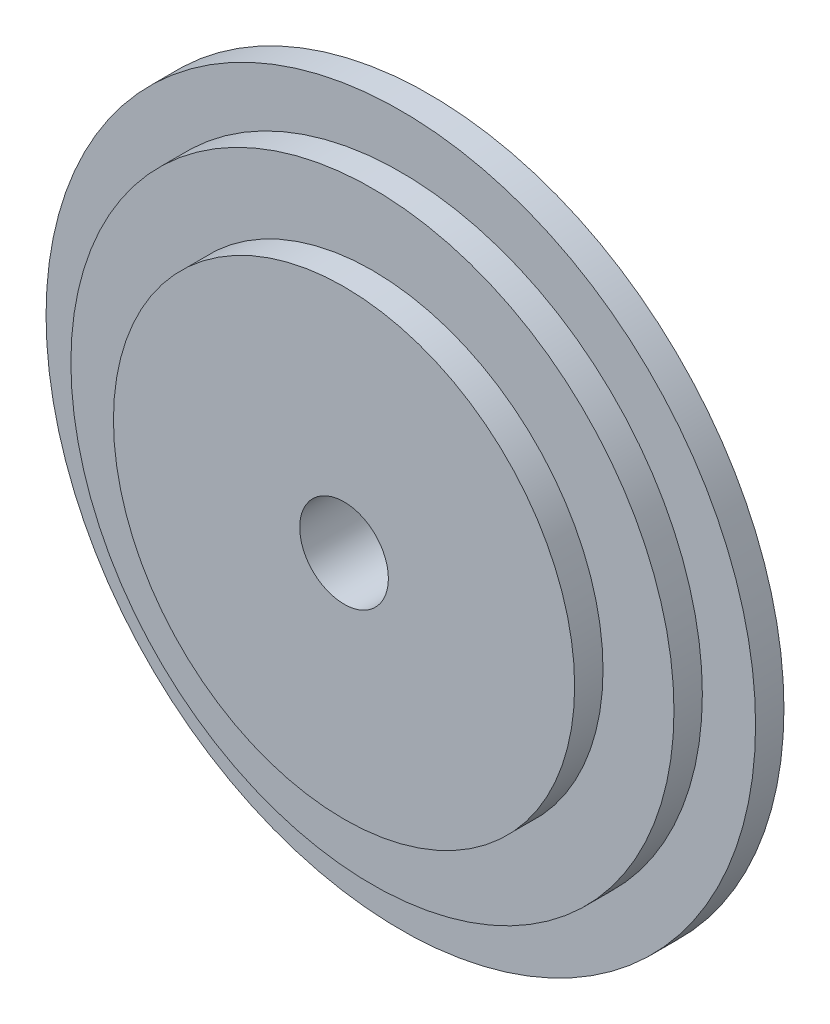
ISO-10303-21;
HEADER;
FILE_DESCRIPTION(('STEP AP214'),'2;1');
FILE_NAME('part.step','',(''),(''),'','','');
FILE_SCHEMA(('AUTOMOTIVE_DESIGN { 1 0 10303 214 1 1 1 1 }'));
ENDSEC;
DATA;
#1=APPLICATION_CONTEXT('core data for automotive mechanical design processes');
#2=APPLICATION_PROTOCOL_DEFINITION('international standard','automotive_design',2000,#1);
#3=PRODUCT_CONTEXT('',#1,'mechanical');
#4=PRODUCT('Part','Part','',(#3));
#5=PRODUCT_RELATED_PRODUCT_CATEGORY('part','',(#4));
#6=PRODUCT_DEFINITION_FORMATION('','',#4);
#7=PRODUCT_DEFINITION_CONTEXT('part definition',#1,'design');
#8=PRODUCT_DEFINITION('design','',#6,#7);
#9=PRODUCT_DEFINITION_SHAPE('','',#8);
#10=(LENGTH_UNIT() NAMED_UNIT(*) SI_UNIT(.MILLI.,.METRE.));
#11=(NAMED_UNIT(*) PLANE_ANGLE_UNIT() SI_UNIT($,.RADIAN.));
#12=(NAMED_UNIT(*) SI_UNIT($,.STERADIAN.) SOLID_ANGLE_UNIT());
#13=UNCERTAINTY_MEASURE_WITH_UNIT(LENGTH_MEASURE(1.E-05),#10,'distance_accuracy_value','');
#14=(GEOMETRIC_REPRESENTATION_CONTEXT(3) GLOBAL_UNCERTAINTY_ASSIGNED_CONTEXT((#13)) GLOBAL_UNIT_ASSIGNED_CONTEXT((#10,
#11,#12)) REPRESENTATION_CONTEXT('',''));
#15=CARTESIAN_POINT('',(0.,0.,0.));
#16=DIRECTION('',(0.,0.,1.));
#17=DIRECTION('',(1.,0.,0.));
#18=AXIS2_PLACEMENT_3D('',#15,#16,#17);
#19=CARTESIAN_POINT('',(0.,0.,8.));
#20=DIRECTION('',(0.,0.,-1.));
#21=DIRECTION('',(-1.,0.,0.));
#22=AXIS2_PLACEMENT_3D('',#19,#20,#21);
#23=CYLINDRICAL_SURFACE('',#22,100.);
#24=CARTESIAN_POINT('',(0.,0.,8.));
#25=DIRECTION('',(0.,0.,1.));
#26=DIRECTION('',(1.,0.,0.));
#27=AXIS2_PLACEMENT_3D('',#24,#25,#26);
#28=CIRCLE('',#27,100.);
#29=CARTESIAN_POINT('',(100.,0.,8.));
#30=VERTEX_POINT('',#29);
#31=EDGE_CURVE('E10',#30,#30,#28,.T.);
#32=ORIENTED_EDGE('',*,*,#31,.F.);
#33=EDGE_LOOP('',(#32));
#34=FACE_BOUND('',#33,.T.);
#35=CARTESIAN_POINT('',(0.,0.,0.));
#36=DIRECTION('',(0.,0.,1.));
#37=DIRECTION('',(1.,0.,0.));
#38=AXIS2_PLACEMENT_3D('',#35,#36,#37);
#39=CIRCLE('',#38,100.);
#40=CARTESIAN_POINT('',(100.,0.,0.));
#41=VERTEX_POINT('',#40);
#42=EDGE_CURVE('E33',#41,#41,#39,.T.);
#43=ORIENTED_EDGE('',*,*,#42,.T.);
#44=EDGE_LOOP('',(#43));
#45=FACE_BOUND('',#44,.T.);
#46=ADVANCED_FACE('F30',(#34,#45),#23,.T.);
#47=CARTESIAN_POINT('',(0.,0.,8.));
#48=DIRECTION('',(0.,0.,1.));
#49=DIRECTION('',(1.,0.,0.));
#50=AXIS2_PLACEMENT_3D('',#47,#48,#49);
#51=PLANE('',#50);
#52=CARTESIAN_POINT('',(0.,0.,8.));
#53=DIRECTION('',(0.,0.,1.));
#54=DIRECTION('',(1.,0.,0.));
#55=AXIS2_PLACEMENT_3D('',#52,#53,#54);
#56=CIRCLE('',#55,85.);
#57=CARTESIAN_POINT('',(85.,0.,8.));
#58=VERTEX_POINT('',#57);
#59=EDGE_CURVE('E42',#58,#58,#56,.T.);
#60=ORIENTED_EDGE('',*,*,#59,.F.);
#61=EDGE_LOOP('',(#60));
#62=FACE_BOUND('',#61,.T.);
#63=ORIENTED_EDGE('',*,*,#31,.T.);
#64=EDGE_LOOP('',(#63));
#65=FACE_BOUND('',#64,.T.);
#66=ADVANCED_FACE('F93',(#62,#65),#51,.T.);
#67=CARTESIAN_POINT('',(0.,0.,0.));
#68=DIRECTION('',(0.,0.,1.));
#69=DIRECTION('',(1.,0.,0.));
#70=AXIS2_PLACEMENT_3D('',#67,#68,#69);
#71=PLANE('',#70);
#72=CARTESIAN_POINT('',(0.,0.,0.));
#73=DIRECTION('',(0.,0.,1.));
#74=DIRECTION('',(1.,0.,0.));
#75=AXIS2_PLACEMENT_3D('',#72,#73,#74);
#76=CIRCLE('',#75,12.5);
#77=CARTESIAN_POINT('',(12.5,0.,0.));
#78=VERTEX_POINT('',#77);
#79=EDGE_CURVE('E51',#78,#78,#76,.T.);
#80=ORIENTED_EDGE('',*,*,#79,.T.);
#81=EDGE_LOOP('',(#80));
#82=FACE_BOUND('',#81,.T.);
#83=ORIENTED_EDGE('',*,*,#42,.F.);
#84=EDGE_LOOP('',(#83));
#85=FACE_BOUND('',#84,.T.);
#86=ADVANCED_FACE('F60',(#82,#85),#71,.F.);
#87=CARTESIAN_POINT('',(0.,0.,16.));
#88=DIRECTION('',(0.,0.,-1.));
#89=DIRECTION('',(-1.,0.,0.));
#90=AXIS2_PLACEMENT_3D('',#87,#88,#89);
#91=CYLINDRICAL_SURFACE('',#90,85.);
#92=CARTESIAN_POINT('',(0.,0.,16.));
#93=DIRECTION('',(0.,0.,1.));
#94=DIRECTION('',(1.,0.,0.));
#95=AXIS2_PLACEMENT_3D('',#92,#93,#94);
#96=CIRCLE('',#95,85.);
#97=CARTESIAN_POINT('',(85.,0.,16.));
#98=VERTEX_POINT('',#97);
#99=EDGE_CURVE('E40',#98,#98,#96,.T.);
#100=ORIENTED_EDGE('',*,*,#99,.F.);
#101=EDGE_LOOP('',(#100));
#102=FACE_BOUND('',#101,.T.);
#103=ORIENTED_EDGE('',*,*,#59,.T.);
#104=EDGE_LOOP('',(#103));
#105=FACE_BOUND('',#104,.T.);
#106=ADVANCED_FACE('F84',(#102,#105),#91,.T.);
#107=CARTESIAN_POINT('',(0.,0.,16.));
#108=DIRECTION('',(0.,0.,1.));
#109=DIRECTION('',(1.,0.,0.));
#110=AXIS2_PLACEMENT_3D('',#107,#108,#109);
#111=PLANE('',#110);
#112=CARTESIAN_POINT('',(0.,0.,16.));
#113=DIRECTION('',(0.,0.,1.));
#114=DIRECTION('',(1.,0.,0.));
#115=AXIS2_PLACEMENT_3D('',#112,#113,#114);
#116=CIRCLE('',#115,65.);
#117=CARTESIAN_POINT('',(65.,0.,16.));
#118=VERTEX_POINT('',#117);
#119=EDGE_CURVE('E48',#118,#118,#116,.T.);
#120=ORIENTED_EDGE('',*,*,#119,.F.);
#121=EDGE_LOOP('',(#120));
#122=FACE_BOUND('',#121,.T.);
#123=ORIENTED_EDGE('',*,*,#99,.T.);
#124=EDGE_LOOP('',(#123));
#125=FACE_BOUND('',#124,.T.);
#126=ADVANCED_FACE('F78',(#122,#125),#111,.T.);
#127=CARTESIAN_POINT('',(0.,0.,24.));
#128=DIRECTION('',(0.,0.,-1.));
#129=DIRECTION('',(-1.,0.,0.));
#130=AXIS2_PLACEMENT_3D('',#127,#128,#129);
#131=CYLINDRICAL_SURFACE('',#130,65.);
#132=CARTESIAN_POINT('',(0.,0.,24.));
#133=DIRECTION('',(0.,0.,1.));
#134=DIRECTION('',(1.,0.,0.));
#135=AXIS2_PLACEMENT_3D('',#132,#133,#134);
#136=CIRCLE('',#135,65.);
#137=CARTESIAN_POINT('',(65.,0.,24.));
#138=VERTEX_POINT('',#137);
#139=EDGE_CURVE('E45',#138,#138,#136,.T.);
#140=ORIENTED_EDGE('',*,*,#139,.F.);
#141=EDGE_LOOP('',(#140));
#142=FACE_BOUND('',#141,.T.);
#143=ORIENTED_EDGE('',*,*,#119,.T.);
#144=EDGE_LOOP('',(#143));
#145=FACE_BOUND('',#144,.T.);
#146=ADVANCED_FACE('F72',(#142,#145),#131,.T.);
#147=CARTESIAN_POINT('',(0.,0.,24.));
#148=DIRECTION('',(0.,0.,1.));
#149=DIRECTION('',(1.,0.,0.));
#150=AXIS2_PLACEMENT_3D('',#147,#148,#149);
#151=PLANE('',#150);
#152=CARTESIAN_POINT('',(0.,0.,24.));
#153=DIRECTION('',(0.,0.,1.));
#154=DIRECTION('',(1.,0.,0.));
#155=AXIS2_PLACEMENT_3D('',#152,#153,#154);
#156=CIRCLE('',#155,12.5);
#157=CARTESIAN_POINT('',(12.5,0.,24.));
#158=VERTEX_POINT('',#157);
#159=EDGE_CURVE('E54',#158,#158,#156,.T.);
#160=ORIENTED_EDGE('',*,*,#159,.F.);
#161=EDGE_LOOP('',(#160));
#162=FACE_BOUND('',#161,.T.);
#163=ORIENTED_EDGE('',*,*,#139,.T.);
#164=EDGE_LOOP('',(#163));
#165=FACE_BOUND('',#164,.T.);
#166=ADVANCED_FACE('F66',(#162,#165),#151,.T.);
#167=CARTESIAN_POINT('',(0.,0.,0.));
#168=DIRECTION('',(0.,0.,1.));
#169=DIRECTION('',(1.,0.,0.));
#170=AXIS2_PLACEMENT_3D('',#167,#168,#169);
#171=CYLINDRICAL_SURFACE('',#170,12.5);
#172=ORIENTED_EDGE('',*,*,#79,.F.);
#173=EDGE_LOOP('',(#172));
#174=FACE_BOUND('',#173,.T.);
#175=ORIENTED_EDGE('',*,*,#159,.T.);
#176=EDGE_LOOP('',(#175));
#177=FACE_BOUND('',#176,.T.);
#178=ADVANCED_FACE('F63',(#174,#177),#171,.F.);
#179=CLOSED_SHELL('',(#46,#66,#86,#106,#126,#146,#166,#178));
#180=MANIFOLD_SOLID_BREP('B2',#179);
#181=ADVANCED_BREP_SHAPE_REPRESENTATION('',(#18,#180),#14);
#182=SHAPE_DEFINITION_REPRESENTATION(#9,#181);
ENDSEC;
END-ISO-10303-21;
